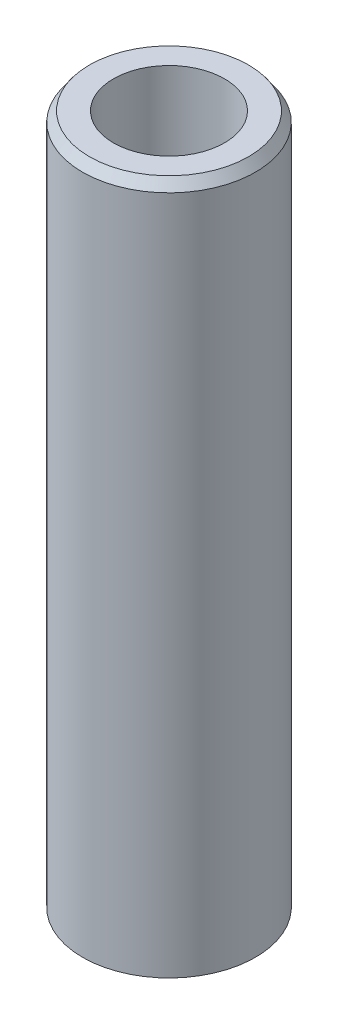
ISO-10303-21;
HEADER;
FILE_DESCRIPTION(('STEP AP214'),'2;1');
FILE_NAME('part.step','',(''),(''),'','','');
FILE_SCHEMA(('AUTOMOTIVE_DESIGN { 1 0 10303 214 1 1 1 1 }'));
ENDSEC;
DATA;
#1=APPLICATION_CONTEXT('core data for automotive mechanical design processes');
#2=APPLICATION_PROTOCOL_DEFINITION('international standard','automotive_design',2000,#1);
#3=PRODUCT_CONTEXT('',#1,'mechanical');
#4=PRODUCT('Part','Part','',(#3));
#5=PRODUCT_RELATED_PRODUCT_CATEGORY('part','',(#4));
#6=PRODUCT_DEFINITION_FORMATION('','',#4);
#7=PRODUCT_DEFINITION_CONTEXT('part definition',#1,'design');
#8=PRODUCT_DEFINITION('design','',#6,#7);
#9=PRODUCT_DEFINITION_SHAPE('','',#8);
#10=(LENGTH_UNIT() NAMED_UNIT(*) SI_UNIT(.MILLI.,.METRE.));
#11=(NAMED_UNIT(*) PLANE_ANGLE_UNIT() SI_UNIT($,.RADIAN.));
#12=(NAMED_UNIT(*) SI_UNIT($,.STERADIAN.) SOLID_ANGLE_UNIT());
#13=UNCERTAINTY_MEASURE_WITH_UNIT(LENGTH_MEASURE(1.E-05),#10,'distance_accuracy_value','');
#14=(GEOMETRIC_REPRESENTATION_CONTEXT(3) GLOBAL_UNCERTAINTY_ASSIGNED_CONTEXT((#13)) GLOBAL_UNIT_ASSIGNED_CONTEXT((#10,
#11,#12)) REPRESENTATION_CONTEXT('',''));
#15=CARTESIAN_POINT('',(0.,0.,0.));
#16=DIRECTION('',(0.,0.,1.));
#17=DIRECTION('',(1.,0.,0.));
#18=AXIS2_PLACEMENT_3D('',#15,#16,#17);
#19=CARTESIAN_POINT('',(0.,201.414738191036,0.));
#20=DIRECTION('',(0.,-1.,0.));
#21=DIRECTION('',(0.,0.,-1.));
#22=AXIS2_PLACEMENT_3D('',#19,#20,#21);
#23=CYLINDRICAL_SURFACE('',#22,25.);
#24=CARTESIAN_POINT('',(0.,198.553983770587,0.));
#25=DIRECTION('',(0.,1.,0.));
#26=DIRECTION('',(0.,0.,1.));
#27=AXIS2_PLACEMENT_3D('',#24,#25,#26);
#28=CIRCLE('',#27,25.);
#29=CARTESIAN_POINT('',(0.,198.553983770587,25.));
#30=VERTEX_POINT('',#29);
#31=EDGE_CURVE('E50',#30,#30,#28,.F.);
#32=ORIENTED_EDGE('',*,*,#31,.T.);
#33=EDGE_LOOP('',(#32));
#34=FACE_BOUND('',#33,.T.);
#35=CARTESIAN_POINT('',(0.,2.00734388306781,0.));
#36=DIRECTION('',(0.,1.,0.));
#37=DIRECTION('',(0.,0.,1.));
#38=AXIS2_PLACEMENT_3D('',#35,#36,#37);
#39=CIRCLE('',#38,25.);
#40=CARTESIAN_POINT('',(0.,2.00734388306781,25.));
#41=VERTEX_POINT('',#40);
#42=EDGE_CURVE('E51',#41,#41,#39,.T.);
#43=ORIENTED_EDGE('',*,*,#42,.T.);
#44=EDGE_LOOP('',(#43));
#45=FACE_BOUND('',#44,.T.);
#46=ADVANCED_FACE('F39',(#34,#45),#23,.T.);
#47=CARTESIAN_POINT('',(0.,201.414738191036,0.));
#48=DIRECTION('',(0.,1.,0.));
#49=DIRECTION('',(0.,0.,1.));
#50=AXIS2_PLACEMENT_3D('',#47,#48,#49);
#51=PLANE('',#50);
#52=CARTESIAN_POINT('',(0.,201.414738191036,0.));
#53=DIRECTION('',(0.,1.,0.));
#54=DIRECTION('',(0.,0.,1.));
#55=AXIS2_PLACEMENT_3D('',#52,#53,#54);
#56=CIRCLE('',#55,22.9926561169322);
#57=CARTESIAN_POINT('',(0.,201.414738191036,22.9926561169322));
#58=VERTEX_POINT('',#57);
#59=EDGE_CURVE('E54',#58,#58,#56,.T.);
#60=ORIENTED_EDGE('',*,*,#59,.T.);
#61=EDGE_LOOP('',(#60));
#62=FACE_BOUND('',#61,.T.);
#63=CARTESIAN_POINT('',(0.,201.414738191036,0.));
#64=DIRECTION('',(0.,1.,0.));
#65=DIRECTION('',(0.,0.,1.));
#66=AXIS2_PLACEMENT_3D('',#63,#64,#65);
#67=CIRCLE('',#66,16.0550375961781);
#68=CARTESIAN_POINT('',(0.,201.414738191036,16.0550375961781));
#69=VERTEX_POINT('',#68);
#70=EDGE_CURVE('E58',#69,#69,#67,.T.);
#71=ORIENTED_EDGE('',*,*,#70,.F.);
#72=EDGE_LOOP('',(#71));
#73=FACE_BOUND('',#72,.T.);
#74=ADVANCED_FACE('F69',(#62,#73),#51,.T.);
#75=CARTESIAN_POINT('',(0.,0.,0.));
#76=DIRECTION('',(0.,1.,0.));
#77=DIRECTION('',(0.,0.,1.));
#78=AXIS2_PLACEMENT_3D('',#75,#76,#77);
#79=PLANE('',#78);
#80=CARTESIAN_POINT('',(0.,0.,0.));
#81=DIRECTION('',(0.,1.,0.));
#82=DIRECTION('',(0.,0.,1.));
#83=AXIS2_PLACEMENT_3D('',#80,#81,#82);
#84=CIRCLE('',#83,22.1392455795507);
#85=CARTESIAN_POINT('',(0.,0.,22.1392455795507));
#86=VERTEX_POINT('',#85);
#87=EDGE_CURVE('E10',#86,#86,#84,.F.);
#88=ORIENTED_EDGE('',*,*,#87,.T.);
#89=EDGE_LOOP('',(#88));
#90=FACE_BOUND('',#89,.T.);
#91=CARTESIAN_POINT('',(0.,0.,0.));
#92=DIRECTION('',(0.,1.,0.));
#93=DIRECTION('',(0.,0.,1.));
#94=AXIS2_PLACEMENT_3D('',#91,#92,#93);
#95=CIRCLE('',#94,16.0550375961781);
#96=CARTESIAN_POINT('',(0.,0.,16.0550375961781));
#97=VERTEX_POINT('',#96);
#98=EDGE_CURVE('E63',#97,#97,#95,.T.);
#99=ORIENTED_EDGE('',*,*,#98,.T.);
#100=EDGE_LOOP('',(#99));
#101=FACE_BOUND('',#100,.T.);
#102=ADVANCED_FACE('F75',(#90,#101),#79,.F.);
#103=CARTESIAN_POINT('',(0.,201.414738191036,0.));
#104=DIRECTION('',(0.,-1.,0.));
#105=DIRECTION('',(0.,0.,-1.));
#106=AXIS2_PLACEMENT_3D('',#103,#104,#105);
#107=CYLINDRICAL_SURFACE('',#106,16.0550375961781);
#108=ORIENTED_EDGE('',*,*,#70,.T.);
#109=EDGE_LOOP('',(#108));
#110=FACE_BOUND('',#109,.T.);
#111=ORIENTED_EDGE('',*,*,#98,.F.);
#112=EDGE_LOOP('',(#111));
#113=FACE_BOUND('',#112,.T.);
#114=ADVANCED_FACE('F70',(#110,#113),#107,.F.);
#115=CARTESIAN_POINT('',(0.,201.414738191036,0.));
#116=DIRECTION('',(0.,-1.,0.));
#117=DIRECTION('',(0.,0.,-1.));
#118=AXIS2_PLACEMENT_3D('',#115,#116,#117);
#119=CONICAL_SURFACE('',#118,22.9926561169322,0.611854868535016);
#120=ORIENTED_EDGE('',*,*,#31,.F.);
#121=EDGE_LOOP('',(#120));
#122=FACE_BOUND('',#121,.T.);
#123=ORIENTED_EDGE('',*,*,#59,.F.);
#124=EDGE_LOOP('',(#123));
#125=FACE_BOUND('',#124,.T.);
#126=ADVANCED_FACE('F81',(#122,#125),#119,.T.);
#127=CARTESIAN_POINT('',(0.,2.00734388306781,0.));
#128=DIRECTION('',(0.,1.,0.));
#129=DIRECTION('',(0.,0.,1.));
#130=AXIS2_PLACEMENT_3D('',#127,#128,#129);
#131=CONICAL_SURFACE('',#130,25.,0.958941458259881);
#132=ORIENTED_EDGE('',*,*,#87,.F.);
#133=EDGE_LOOP('',(#132));
#134=FACE_BOUND('',#133,.T.);
#135=ORIENTED_EDGE('',*,*,#42,.F.);
#136=EDGE_LOOP('',(#135));
#137=FACE_BOUND('',#136,.T.);
#138=ADVANCED_FACE('F45',(#134,#137),#131,.T.);
#139=CLOSED_SHELL('',(#46,#74,#102,#114,#126,#138));
#140=MANIFOLD_SOLID_BREP('B2',#139);
#141=ADVANCED_BREP_SHAPE_REPRESENTATION('',(#18,#140),#14);
#142=SHAPE_DEFINITION_REPRESENTATION(#9,#141);
ENDSEC;
END-ISO-10303-21;
